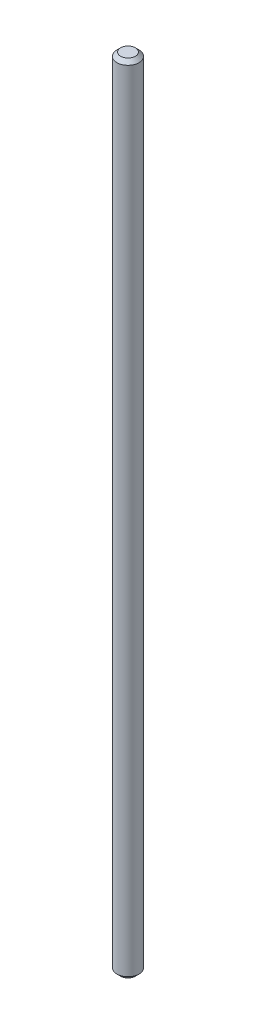
ISO-10303-21;
HEADER;
FILE_DESCRIPTION(('STEP AP214'),'2;1');
FILE_NAME('part.step','',(''),(''),'','','');
FILE_SCHEMA(('AUTOMOTIVE_DESIGN { 1 0 10303 214 1 1 1 1 }'));
ENDSEC;
DATA;
#1=APPLICATION_CONTEXT('core data for automotive mechanical design processes');
#2=APPLICATION_PROTOCOL_DEFINITION('international standard','automotive_design',2000,#1);
#3=PRODUCT_CONTEXT('',#1,'mechanical');
#4=PRODUCT('Part','Part','',(#3));
#5=PRODUCT_RELATED_PRODUCT_CATEGORY('part','',(#4));
#6=PRODUCT_DEFINITION_FORMATION('','',#4);
#7=PRODUCT_DEFINITION_CONTEXT('part definition',#1,'design');
#8=PRODUCT_DEFINITION('design','',#6,#7);
#9=PRODUCT_DEFINITION_SHAPE('','',#8);
#10=(LENGTH_UNIT() NAMED_UNIT(*) SI_UNIT(.MILLI.,.METRE.));
#11=(NAMED_UNIT(*) PLANE_ANGLE_UNIT() SI_UNIT($,.RADIAN.));
#12=(NAMED_UNIT(*) SI_UNIT($,.STERADIAN.) SOLID_ANGLE_UNIT());
#13=UNCERTAINTY_MEASURE_WITH_UNIT(LENGTH_MEASURE(1.E-05),#10,'distance_accuracy_value','');
#14=(GEOMETRIC_REPRESENTATION_CONTEXT(3) GLOBAL_UNCERTAINTY_ASSIGNED_CONTEXT((#13)) GLOBAL_UNIT_ASSIGNED_CONTEXT((#10,
#11,#12)) REPRESENTATION_CONTEXT('',''));
#15=CARTESIAN_POINT('',(0.,0.,0.));
#16=DIRECTION('',(0.,0.,1.));
#17=DIRECTION('',(1.,0.,0.));
#18=AXIS2_PLACEMENT_3D('',#15,#16,#17);
#19=CARTESIAN_POINT('',(0.,108.,0.));
#20=DIRECTION('',(0.,-1.,0.));
#21=DIRECTION('',(0.,0.,-1.));
#22=AXIS2_PLACEMENT_3D('',#19,#20,#21);
#23=CYLINDRICAL_SURFACE('',#22,1.5);
#24=CARTESIAN_POINT('',(0.,107.5,0.));
#25=DIRECTION('',(0.,1.,0.));
#26=DIRECTION('',(0.,0.,1.));
#27=AXIS2_PLACEMENT_3D('',#24,#25,#26);
#28=CIRCLE('',#27,1.5);
#29=CARTESIAN_POINT('',(0.,107.5,1.5));
#30=VERTEX_POINT('',#29);
#31=EDGE_CURVE('E41',#30,#30,#28,.F.);
#32=ORIENTED_EDGE('',*,*,#31,.T.);
#33=EDGE_LOOP('',(#32));
#34=FACE_BOUND('',#33,.T.);
#35=CARTESIAN_POINT('',(0.,0.500000000000014,0.));
#36=DIRECTION('',(0.,1.,0.));
#37=DIRECTION('',(0.,0.,1.));
#38=AXIS2_PLACEMENT_3D('',#35,#36,#37);
#39=CIRCLE('',#38,1.5);
#40=CARTESIAN_POINT('',(0.,0.500000000000014,1.5));
#41=VERTEX_POINT('',#40);
#42=EDGE_CURVE('E45',#41,#41,#39,.T.);
#43=ORIENTED_EDGE('',*,*,#42,.T.);
#44=EDGE_LOOP('',(#43));
#45=FACE_BOUND('',#44,.T.);
#46=ADVANCED_FACE('F34',(#34,#45),#23,.T.);
#47=CARTESIAN_POINT('',(0.,108.,0.));
#48=DIRECTION('',(0.,1.,0.));
#49=DIRECTION('',(0.,0.,1.));
#50=AXIS2_PLACEMENT_3D('',#47,#48,#49);
#51=PLANE('',#50);
#52=CARTESIAN_POINT('',(0.,108.,0.));
#53=DIRECTION('',(0.,1.,0.));
#54=DIRECTION('',(0.,0.,1.));
#55=AXIS2_PLACEMENT_3D('',#52,#53,#54);
#56=CIRCLE('',#55,0.999999999999987);
#57=CARTESIAN_POINT('',(0.,108.,0.999999999999987));
#58=VERTEX_POINT('',#57);
#59=EDGE_CURVE('E49',#58,#58,#56,.T.);
#60=ORIENTED_EDGE('',*,*,#59,.T.);
#61=EDGE_LOOP('',(#60));
#62=FACE_BOUND('',#61,.T.);
#63=ADVANCED_FACE('F55',(#62),#51,.T.);
#64=CARTESIAN_POINT('',(0.,0.,0.));
#65=DIRECTION('',(0.,1.,0.));
#66=DIRECTION('',(0.,0.,1.));
#67=AXIS2_PLACEMENT_3D('',#64,#65,#66);
#68=PLANE('',#67);
#69=CARTESIAN_POINT('',(0.,0.,0.));
#70=DIRECTION('',(0.,1.,0.));
#71=DIRECTION('',(0.,0.,1.));
#72=AXIS2_PLACEMENT_3D('',#69,#70,#71);
#73=CIRCLE('',#72,0.999999999999987);
#74=CARTESIAN_POINT('',(0.,0.,0.999999999999987));
#75=VERTEX_POINT('',#74);
#76=EDGE_CURVE('E10',#75,#75,#73,.F.);
#77=ORIENTED_EDGE('',*,*,#76,.T.);
#78=EDGE_LOOP('',(#77));
#79=FACE_BOUND('',#78,.T.);
#80=ADVANCED_FACE('F59',(#79),#68,.F.);
#81=CARTESIAN_POINT('',(0.,108.,0.));
#82=DIRECTION('',(0.,-1.,0.));
#83=DIRECTION('',(0.,0.,-1.));
#84=AXIS2_PLACEMENT_3D('',#81,#82,#83);
#85=CONICAL_SURFACE('',#84,0.999999999999987,0.785398163397447);
#86=ORIENTED_EDGE('',*,*,#31,.F.);
#87=EDGE_LOOP('',(#86));
#88=FACE_BOUND('',#87,.T.);
#89=ORIENTED_EDGE('',*,*,#59,.F.);
#90=EDGE_LOOP('',(#89));
#91=FACE_BOUND('',#90,.T.);
#92=ADVANCED_FACE('F57',(#88,#91),#85,.T.);
#93=CARTESIAN_POINT('',(0.,0.500000000000014,0.));
#94=DIRECTION('',(0.,1.,0.));
#95=DIRECTION('',(0.,0.,1.));
#96=AXIS2_PLACEMENT_3D('',#93,#94,#95);
#97=CONICAL_SURFACE('',#96,1.5,0.785398163397447);
#98=ORIENTED_EDGE('',*,*,#76,.F.);
#99=EDGE_LOOP('',(#98));
#100=FACE_BOUND('',#99,.T.);
#101=ORIENTED_EDGE('',*,*,#42,.F.);
#102=EDGE_LOOP('',(#101));
#103=FACE_BOUND('',#102,.T.);
#104=ADVANCED_FACE('F36',(#100,#103),#97,.T.);
#105=CLOSED_SHELL('',(#46,#63,#80,#92,#104));
#106=MANIFOLD_SOLID_BREP('B2',#105);
#107=ADVANCED_BREP_SHAPE_REPRESENTATION('',(#18,#106),#14);
#108=SHAPE_DEFINITION_REPRESENTATION(#9,#107);
ENDSEC;
END-ISO-10303-21;
